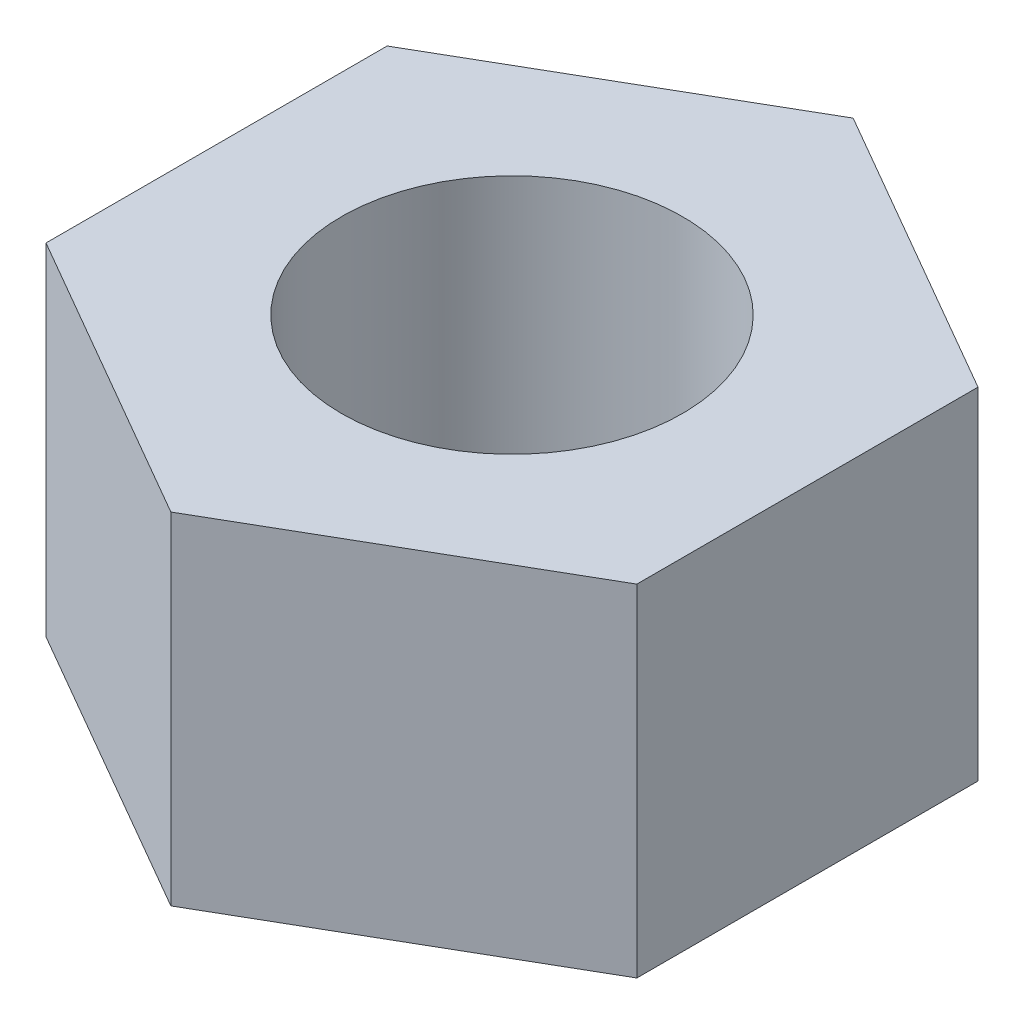
ISO-10303-21;
HEADER;
FILE_DESCRIPTION(('STEP AP214'),'2;1');
FILE_NAME('part.step','',(''),(''),'','','');
FILE_SCHEMA(('AUTOMOTIVE_DESIGN { 1 0 10303 214 1 1 1 1 }'));
ENDSEC;
DATA;
#1=APPLICATION_CONTEXT('core data for automotive mechanical design processes');
#2=APPLICATION_PROTOCOL_DEFINITION('international standard','automotive_design',2000,#1);
#3=PRODUCT_CONTEXT('',#1,'mechanical');
#4=PRODUCT('Part','Part','',(#3));
#5=PRODUCT_RELATED_PRODUCT_CATEGORY('part','',(#4));
#6=PRODUCT_DEFINITION_FORMATION('','',#4);
#7=PRODUCT_DEFINITION_CONTEXT('part definition',#1,'design');
#8=PRODUCT_DEFINITION('design','',#6,#7);
#9=PRODUCT_DEFINITION_SHAPE('','',#8);
#10=(LENGTH_UNIT() NAMED_UNIT(*) SI_UNIT(.MILLI.,.METRE.));
#11=(NAMED_UNIT(*) PLANE_ANGLE_UNIT() SI_UNIT($,.RADIAN.));
#12=(NAMED_UNIT(*) SI_UNIT($,.STERADIAN.) SOLID_ANGLE_UNIT());
#13=UNCERTAINTY_MEASURE_WITH_UNIT(LENGTH_MEASURE(1.E-05),#10,'distance_accuracy_value','');
#14=(GEOMETRIC_REPRESENTATION_CONTEXT(3) GLOBAL_UNCERTAINTY_ASSIGNED_CONTEXT((#13)) GLOBAL_UNIT_ASSIGNED_CONTEXT((#10,
#11,#12)) REPRESENTATION_CONTEXT('',''));
#15=CARTESIAN_POINT('',(0.,0.,0.));
#16=DIRECTION('',(0.,0.,1.));
#17=DIRECTION('',(1.,0.,0.));
#18=AXIS2_PLACEMENT_3D('',#15,#16,#17);
#19=CARTESIAN_POINT('',(7.79422863405997,9.,-4.50000000000014));
#20=DIRECTION('',(-0.499999999999995,0.,0.866025403784442));
#21=DIRECTION('',(0.866025403784442,0.,0.499999999999995));
#22=AXIS2_PLACEMENT_3D('',#19,#20,#21);
#23=PLANE('',#22);
#24=DIRECTION('',(-0.866025403784442,0.,-0.499999999999995));
#25=VECTOR('',#24,1.);
#26=CARTESIAN_POINT('',(7.79422863405997,0.,-4.50000000000014));
#27=LINE('',#26,#25);
#28=CARTESIAN_POINT('',(7.79422863405997,0.,-4.50000000000014));
#29=VERTEX_POINT('',#28);
#30=CARTESIAN_POINT('',(0.,0.,-9.00000000000009));
#31=VERTEX_POINT('',#30);
#32=EDGE_CURVE('E117',#29,#31,#27,.T.);
#33=ORIENTED_EDGE('',*,*,#32,.T.);
#34=DIRECTION('',(0.,-1.,0.));
#35=VECTOR('',#34,1.);
#36=CARTESIAN_POINT('',(0.,9.,-9.00000000000009));
#37=LINE('',#36,#35);
#38=CARTESIAN_POINT('',(0.,9.,-9.00000000000009));
#39=VERTEX_POINT('',#38);
#40=EDGE_CURVE('E11',#39,#31,#37,.T.);
#41=ORIENTED_EDGE('',*,*,#40,.F.);
#42=DIRECTION('',(-0.866025403784442,0.,-0.499999999999995));
#43=VECTOR('',#42,1.);
#44=CARTESIAN_POINT('',(7.79422863405997,9.,-4.50000000000014));
#45=LINE('',#44,#43);
#46=CARTESIAN_POINT('',(7.79422863405997,9.,-4.50000000000014));
#47=VERTEX_POINT('',#46);
#48=EDGE_CURVE('E128',#47,#39,#45,.T.);
#49=ORIENTED_EDGE('',*,*,#48,.F.);
#50=DIRECTION('',(0.,-1.,0.));
#51=VECTOR('',#50,1.);
#52=CARTESIAN_POINT('',(7.79422863405997,9.,-4.50000000000014));
#53=LINE('',#52,#51);
#54=EDGE_CURVE('E113',#47,#29,#53,.T.);
#55=ORIENTED_EDGE('',*,*,#54,.T.);
#56=EDGE_LOOP('',(#33,#41,#49,#55));
#57=FACE_BOUND('',#56,.T.);
#58=ADVANCED_FACE('F33',(#57),#23,.F.);
#59=CARTESIAN_POINT('',(0.,9.,-9.00000000000009));
#60=DIRECTION('',(0.500000000000001,0.,0.866025403784438));
#61=DIRECTION('',(0.866025403784438,0.,-0.500000000000001));
#62=AXIS2_PLACEMENT_3D('',#59,#60,#61);
#63=PLANE('',#62);
#64=DIRECTION('',(-0.866025403784438,0.,0.500000000000001));
#65=VECTOR('',#64,1.);
#66=CARTESIAN_POINT('',(0.,0.,-9.00000000000009));
#67=LINE('',#66,#65);
#68=CARTESIAN_POINT('',(-7.79422863406004,0.,-4.50000000000003));
#69=VERTEX_POINT('',#68);
#70=EDGE_CURVE('E120',#31,#69,#67,.T.);
#71=ORIENTED_EDGE('',*,*,#70,.T.);
#72=DIRECTION('',(0.,-1.,0.));
#73=VECTOR('',#72,1.);
#74=CARTESIAN_POINT('',(-7.79422863406004,9.,-4.50000000000003));
#75=LINE('',#74,#73);
#76=CARTESIAN_POINT('',(-7.79422863406004,9.,-4.50000000000003));
#77=VERTEX_POINT('',#76);
#78=EDGE_CURVE('E41',#77,#69,#75,.T.);
#79=ORIENTED_EDGE('',*,*,#78,.F.);
#80=DIRECTION('',(-0.866025403784438,0.,0.500000000000001));
#81=VECTOR('',#80,1.);
#82=CARTESIAN_POINT('',(0.,9.,-9.00000000000009));
#83=LINE('',#82,#81);
#84=EDGE_CURVE('E86',#39,#77,#83,.T.);
#85=ORIENTED_EDGE('',*,*,#84,.F.);
#86=ORIENTED_EDGE('',*,*,#40,.T.);
#87=EDGE_LOOP('',(#71,#79,#85,#86));
#88=FACE_BOUND('',#87,.T.);
#89=ADVANCED_FACE('F153',(#88),#63,.F.);
#90=CARTESIAN_POINT('',(-7.79422863406004,9.,-4.50000000000003));
#91=DIRECTION('',(1.,0.,0.));
#92=DIRECTION('',(0.,0.,-1.));
#93=AXIS2_PLACEMENT_3D('',#90,#91,#92);
#94=PLANE('',#93);
#95=DIRECTION('',(0.,0.,1.));
#96=VECTOR('',#95,1.);
#97=CARTESIAN_POINT('',(-7.79422863406004,0.,-4.50000000000003));
#98=LINE('',#97,#96);
#99=CARTESIAN_POINT('',(-7.79422863406,0.,4.50000000000008));
#100=VERTEX_POINT('',#99);
#101=EDGE_CURVE('E123',#69,#100,#98,.T.);
#102=ORIENTED_EDGE('',*,*,#101,.T.);
#103=DIRECTION('',(0.,-1.,0.));
#104=VECTOR('',#103,1.);
#105=CARTESIAN_POINT('',(-7.79422863406,9.,4.50000000000008));
#106=LINE('',#105,#104);
#107=CARTESIAN_POINT('',(-7.79422863406,9.,4.50000000000008));
#108=VERTEX_POINT('',#107);
#109=EDGE_CURVE('E108',#108,#100,#106,.T.);
#110=ORIENTED_EDGE('',*,*,#109,.F.);
#111=DIRECTION('',(0.,0.,1.));
#112=VECTOR('',#111,1.);
#113=CARTESIAN_POINT('',(-7.79422863406004,9.,-4.50000000000003));
#114=LINE('',#113,#112);
#115=EDGE_CURVE('E99',#77,#108,#114,.T.);
#116=ORIENTED_EDGE('',*,*,#115,.F.);
#117=ORIENTED_EDGE('',*,*,#78,.T.);
#118=EDGE_LOOP('',(#102,#110,#116,#117));
#119=FACE_BOUND('',#118,.T.);
#120=ADVANCED_FACE('F134',(#119),#94,.F.);
#121=CARTESIAN_POINT('',(-7.79422863406,9.,4.50000000000008));
#122=DIRECTION('',(0.499999999999995,0.,-0.866025403784442));
#123=DIRECTION('',(-0.866025403784442,0.,-0.499999999999995));
#124=AXIS2_PLACEMENT_3D('',#121,#122,#123);
#125=PLANE('',#124);
#126=DIRECTION('',(0.866025403784441,0.,0.499999999999995));
#127=VECTOR('',#126,1.);
#128=CARTESIAN_POINT('',(-7.79422863406,0.,4.50000000000008));
#129=LINE('',#128,#127);
#130=CARTESIAN_POINT('',(0.,0.,9.00000000000009));
#131=VERTEX_POINT('',#130);
#132=EDGE_CURVE('E107',#100,#131,#129,.T.);
#133=ORIENTED_EDGE('',*,*,#132,.T.);
#134=DIRECTION('',(0.,-1.,0.));
#135=VECTOR('',#134,1.);
#136=CARTESIAN_POINT('',(0.,9.,9.00000000000009));
#137=LINE('',#136,#135);
#138=CARTESIAN_POINT('',(0.,9.,9.00000000000009));
#139=VERTEX_POINT('',#138);
#140=EDGE_CURVE('E104',#139,#131,#137,.T.);
#141=ORIENTED_EDGE('',*,*,#140,.F.);
#142=DIRECTION('',(0.866025403784441,0.,0.499999999999995));
#143=VECTOR('',#142,1.);
#144=CARTESIAN_POINT('',(-7.79422863406,9.,4.50000000000008));
#145=LINE('',#144,#143);
#146=EDGE_CURVE('E93',#108,#139,#145,.T.);
#147=ORIENTED_EDGE('',*,*,#146,.F.);
#148=ORIENTED_EDGE('',*,*,#109,.T.);
#149=EDGE_LOOP('',(#133,#141,#147,#148));
#150=FACE_BOUND('',#149,.T.);
#151=ADVANCED_FACE('F105',(#150),#125,.F.);
#152=CARTESIAN_POINT('',(0.,9.,9.00000000000009));
#153=DIRECTION('',(-0.500000000000007,0.,-0.866025403784434));
#154=DIRECTION('',(-0.866025403784435,0.,0.500000000000007));
#155=AXIS2_PLACEMENT_3D('',#152,#153,#154);
#156=PLANE('',#155);
#157=DIRECTION('',(0.866025403784435,0.,-0.500000000000007));
#158=VECTOR('',#157,1.);
#159=CARTESIAN_POINT('',(0.,0.,9.00000000000009));
#160=LINE('',#159,#158);
#161=CARTESIAN_POINT('',(7.79422863406007,0.,4.49999999999997));
#162=VERTEX_POINT('',#161);
#163=EDGE_CURVE('E72',#131,#162,#160,.T.);
#164=ORIENTED_EDGE('',*,*,#163,.T.);
#165=DIRECTION('',(0.,-1.,0.));
#166=VECTOR('',#165,1.);
#167=CARTESIAN_POINT('',(7.79422863406007,9.,4.49999999999997));
#168=LINE('',#167,#166);
#169=CARTESIAN_POINT('',(7.79422863406007,9.,4.49999999999997));
#170=VERTEX_POINT('',#169);
#171=EDGE_CURVE('E109',#170,#162,#168,.T.);
#172=ORIENTED_EDGE('',*,*,#171,.F.);
#173=DIRECTION('',(0.866025403784435,0.,-0.500000000000007));
#174=VECTOR('',#173,1.);
#175=CARTESIAN_POINT('',(0.,9.,9.00000000000009));
#176=LINE('',#175,#174);
#177=EDGE_CURVE('E97',#139,#170,#176,.T.);
#178=ORIENTED_EDGE('',*,*,#177,.F.);
#179=ORIENTED_EDGE('',*,*,#140,.T.);
#180=EDGE_LOOP('',(#164,#172,#178,#179));
#181=FACE_BOUND('',#180,.T.);
#182=ADVANCED_FACE('F111',(#181),#156,.F.);
#183=CARTESIAN_POINT('',(7.79422863406007,9.,4.49999999999997));
#184=DIRECTION('',(-1.,0.,0.));
#185=DIRECTION('',(0.,0.,1.));
#186=AXIS2_PLACEMENT_3D('',#183,#184,#185);
#187=PLANE('',#186);
#188=DIRECTION('',(0.,0.,-1.));
#189=VECTOR('',#188,1.);
#190=CARTESIAN_POINT('',(7.79422863406007,0.,4.49999999999997));
#191=LINE('',#190,#189);
#192=EDGE_CURVE('E78',#162,#29,#191,.T.);
#193=ORIENTED_EDGE('',*,*,#192,.T.);
#194=ORIENTED_EDGE('',*,*,#54,.F.);
#195=DIRECTION('',(0.,0.,-1.));
#196=VECTOR('',#195,1.);
#197=CARTESIAN_POINT('',(7.79422863406007,9.,4.49999999999997));
#198=LINE('',#197,#196);
#199=EDGE_CURVE('E49',#170,#47,#198,.T.);
#200=ORIENTED_EDGE('',*,*,#199,.F.);
#201=ORIENTED_EDGE('',*,*,#171,.T.);
#202=EDGE_LOOP('',(#193,#194,#200,#201));
#203=FACE_BOUND('',#202,.T.);
#204=ADVANCED_FACE('F141',(#203),#187,.F.);
#205=CARTESIAN_POINT('',(0.,9.,0.));
#206=DIRECTION('',(0.,1.,0.));
#207=DIRECTION('',(0.,0.,1.));
#208=AXIS2_PLACEMENT_3D('',#205,#206,#207);
#209=PLANE('',#208);
#210=CARTESIAN_POINT('',(0.,9.,0.));
#211=DIRECTION('',(0.,1.,0.));
#212=DIRECTION('',(0.,0.,1.));
#213=AXIS2_PLACEMENT_3D('',#210,#211,#212);
#214=CIRCLE('',#213,4.5);
#215=CARTESIAN_POINT('',(0.,9.,4.5));
#216=VERTEX_POINT('',#215);
#217=EDGE_CURVE('E208',#216,#216,#214,.T.);
#218=ORIENTED_EDGE('',*,*,#217,.F.);
#219=EDGE_LOOP('',(#218));
#220=FACE_BOUND('',#219,.T.);
#221=ORIENTED_EDGE('',*,*,#48,.T.);
#222=ORIENTED_EDGE('',*,*,#84,.T.);
#223=ORIENTED_EDGE('',*,*,#115,.T.);
#224=ORIENTED_EDGE('',*,*,#146,.T.);
#225=ORIENTED_EDGE('',*,*,#177,.T.);
#226=ORIENTED_EDGE('',*,*,#199,.T.);
#227=EDGE_LOOP('',(#221,#222,#223,#224,#225,#226));
#228=FACE_BOUND('',#227,.T.);
#229=ADVANCED_FACE('F95',(#220,#228),#209,.T.);
#230=CARTESIAN_POINT('',(0.,0.,0.));
#231=DIRECTION('',(0.,1.,0.));
#232=DIRECTION('',(0.,0.,1.));
#233=AXIS2_PLACEMENT_3D('',#230,#231,#232);
#234=PLANE('',#233);
#235=CARTESIAN_POINT('',(0.,0.,0.));
#236=DIRECTION('',(0.,1.,0.));
#237=DIRECTION('',(0.,0.,1.));
#238=AXIS2_PLACEMENT_3D('',#235,#236,#237);
#239=CIRCLE('',#238,4.5);
#240=CARTESIAN_POINT('',(0.,0.,4.5));
#241=VERTEX_POINT('',#240);
#242=EDGE_CURVE('E121',#241,#241,#239,.T.);
#243=ORIENTED_EDGE('',*,*,#242,.T.);
#244=EDGE_LOOP('',(#243));
#245=FACE_BOUND('',#244,.T.);
#246=ORIENTED_EDGE('',*,*,#32,.F.);
#247=ORIENTED_EDGE('',*,*,#192,.F.);
#248=ORIENTED_EDGE('',*,*,#163,.F.);
#249=ORIENTED_EDGE('',*,*,#132,.F.);
#250=ORIENTED_EDGE('',*,*,#101,.F.);
#251=ORIENTED_EDGE('',*,*,#70,.F.);
#252=EDGE_LOOP('',(#246,#247,#248,#249,#250,#251));
#253=FACE_BOUND('',#252,.T.);
#254=ADVANCED_FACE('F137',(#245,#253),#234,.F.);
#255=CARTESIAN_POINT('',(0.,0.,0.));
#256=DIRECTION('',(0.,1.,0.));
#257=DIRECTION('',(0.,0.,1.));
#258=AXIS2_PLACEMENT_3D('',#255,#256,#257);
#259=CYLINDRICAL_SURFACE('',#258,4.5);
#260=ORIENTED_EDGE('',*,*,#242,.F.);
#261=EDGE_LOOP('',(#260));
#262=FACE_BOUND('',#261,.T.);
#263=ORIENTED_EDGE('',*,*,#217,.T.);
#264=EDGE_LOOP('',(#263));
#265=FACE_BOUND('',#264,.T.);
#266=ADVANCED_FACE('F190',(#262,#265),#259,.F.);
#267=CLOSED_SHELL('',(#58,#89,#120,#151,#182,#204,#229,#254,#266));
#268=MANIFOLD_SOLID_BREP('B2',#267);
#269=ADVANCED_BREP_SHAPE_REPRESENTATION('',(#18,#268),#14);
#270=SHAPE_DEFINITION_REPRESENTATION(#9,#269);
ENDSEC;
END-ISO-10303-21;
